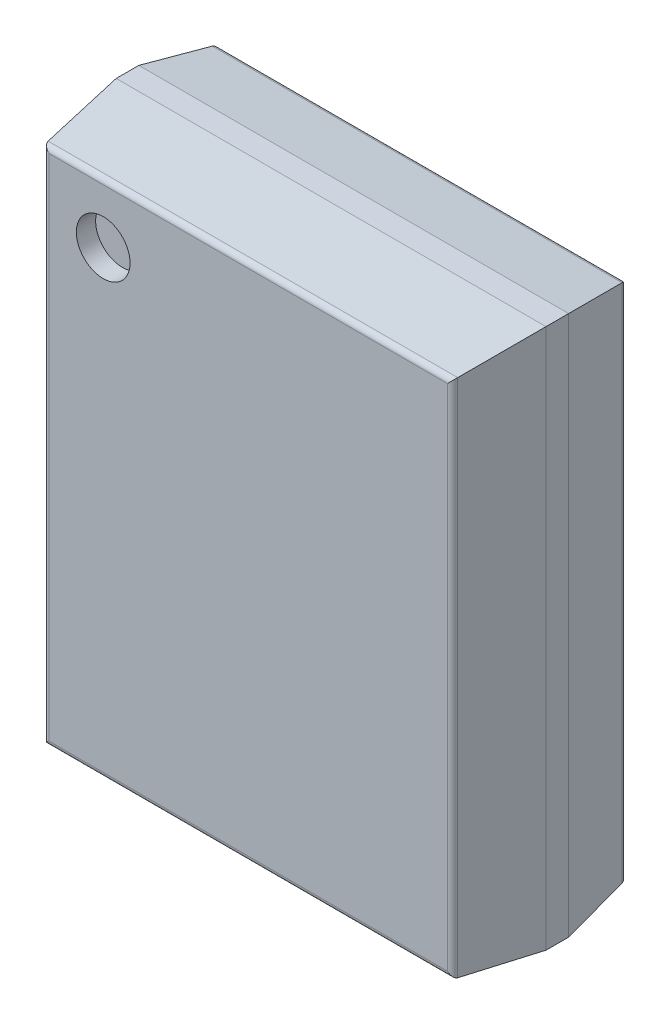
ISO-10303-21;
HEADER;
FILE_DESCRIPTION(('STEP AP214'),'2;1');
FILE_NAME('part.step','',(''),(''),'','','');
FILE_SCHEMA(('AUTOMOTIVE_DESIGN { 1 0 10303 214 1 1 1 1 }'));
ENDSEC;
DATA;
#1=APPLICATION_CONTEXT('core data for automotive mechanical design processes');
#2=APPLICATION_PROTOCOL_DEFINITION('international standard','automotive_design',2000,#1);
#3=PRODUCT_CONTEXT('',#1,'mechanical');
#4=PRODUCT('Part','Part','',(#3));
#5=PRODUCT_RELATED_PRODUCT_CATEGORY('part','',(#4));
#6=PRODUCT_DEFINITION_FORMATION('','',#4);
#7=PRODUCT_DEFINITION_CONTEXT('part definition',#1,'design');
#8=PRODUCT_DEFINITION('design','',#6,#7);
#9=PRODUCT_DEFINITION_SHAPE('','',#8);
#10=(LENGTH_UNIT() NAMED_UNIT(*) SI_UNIT(.MILLI.,.METRE.));
#11=(NAMED_UNIT(*) PLANE_ANGLE_UNIT() SI_UNIT($,.RADIAN.));
#12=(NAMED_UNIT(*) SI_UNIT($,.STERADIAN.) SOLID_ANGLE_UNIT());
#13=UNCERTAINTY_MEASURE_WITH_UNIT(LENGTH_MEASURE(1.E-05),#10,'distance_accuracy_value','');
#14=(GEOMETRIC_REPRESENTATION_CONTEXT(3) GLOBAL_UNCERTAINTY_ASSIGNED_CONTEXT((#13)) GLOBAL_UNIT_ASSIGNED_CONTEXT((#10,
#11,#12)) REPRESENTATION_CONTEXT('',''));
#15=CARTESIAN_POINT('',(0.,0.,0.));
#16=DIRECTION('',(0.,0.,1.));
#17=DIRECTION('',(1.,0.,0.));
#18=AXIS2_PLACEMENT_3D('',#15,#16,#17);
#19=CARTESIAN_POINT('',(-1.315,1.815,1.575));
#20=DIRECTION('',(0.,0.,1.));
#21=DIRECTION('',(1.,0.,0.));
#22=AXIS2_PLACEMENT_3D('',#19,#20,#21);
#23=PLANE('',#22);
#24=CARTESIAN_POINT('',(-1.315,1.815,1.575));
#25=DIRECTION('',(0.,0.,1.));
#26=DIRECTION('',(1.,0.,0.));
#27=AXIS2_PLACEMENT_3D('',#24,#25,#26);
#28=CIRCLE('',#27,0.24375);
#29=CARTESIAN_POINT('',(-1.07125,1.815,1.575));
#30=VERTEX_POINT('',#29);
#31=EDGE_CURVE('E11',#30,#30,#28,.T.);
#32=ORIENTED_EDGE('',*,*,#31,.T.);
#33=EDGE_LOOP('',(#32));
#34=FACE_BOUND('',#33,.T.);
#35=ADVANCED_FACE('F17',(#34),#23,.T.);
#36=CARTESIAN_POINT('',(-1.315,1.815,1.575));
#37=DIRECTION('',(0.,0.,1.));
#38=DIRECTION('',(1.,0.,0.));
#39=AXIS2_PLACEMENT_3D('',#36,#37,#38);
#40=CYLINDRICAL_SURFACE('',#39,0.24375);
#41=DIRECTION('',(0.,0.,1.));
#42=VECTOR('',#41,1.);
#43=CARTESIAN_POINT('',(-1.07125,1.815,1.575));
#44=LINE('',#43,#42);
#45=CARTESIAN_POINT('',(-1.07125,1.815,1.75));
#46=VERTEX_POINT('',#45);
#47=EDGE_CURVE('E25',#30,#46,#44,.T.);
#48=ORIENTED_EDGE('',*,*,#47,.T.);
#49=CARTESIAN_POINT('',(-1.315,1.815,1.75));
#50=DIRECTION('',(0.,0.,1.));
#51=DIRECTION('',(1.,0.,0.));
#52=AXIS2_PLACEMENT_3D('',#49,#50,#51);
#53=CIRCLE('',#52,0.24375);
#54=EDGE_CURVE('E246',#46,#46,#53,.T.);
#55=ORIENTED_EDGE('',*,*,#54,.T.);
#56=ORIENTED_EDGE('',*,*,#47,.F.);
#57=ORIENTED_EDGE('',*,*,#31,.F.);
#58=EDGE_LOOP('',(#48,#55,#56,#57));
#59=FACE_BOUND('',#58,.T.);
#60=ADVANCED_FACE('F708',(#59),#40,.F.);
#61=CARTESIAN_POINT('',(1.808558552786,-2.3525,1.7));
#62=DIRECTION('',(0.,1.,0.));
#63=DIRECTION('',(0.,0.,1.));
#64=AXIS2_PLACEMENT_3D('',#61,#62,#63);
#65=CYLINDRICAL_SURFACE('',#64,0.05);
#66=CARTESIAN_POINT('',(1.808558552786,-2.308558552786,1.7));
#67=DIRECTION('',(-0.707106781186548,-0.707106781186548,0.));
#68=DIRECTION('',(0.707106781186548,-0.707106781186548,0.));
#69=AXIS2_PLACEMENT_3D('',#66,#67,#68);
#70=ELLIPSE('',#69,0.07071067811865,0.05);
#71=CARTESIAN_POINT('',(1.858144342698,-2.358144342698,1.706422572601));
#72=VERTEX_POINT('',#71);
#73=CARTESIAN_POINT('',(1.808558552786,-2.308558552786,1.75));
#74=VERTEX_POINT('',#73);
#75=EDGE_CURVE('E212',#72,#74,#70,.T.);
#76=ORIENTED_EDGE('',*,*,#75,.F.);
#77=DIRECTION('',(0.,1.,0.));
#78=VECTOR('',#77,1.);
#79=CARTESIAN_POINT('',(1.858144342698,-2.3525,1.706422572601));
#80=LINE('',#79,#78);
#81=CARTESIAN_POINT('',(1.858144342698,2.358144342698,1.706422572601));
#82=VERTEX_POINT('',#81);
#83=EDGE_CURVE('E217',#72,#82,#80,.T.);
#84=ORIENTED_EDGE('',*,*,#83,.T.);
#85=CARTESIAN_POINT('',(1.808558552786,2.308558552786,1.7));
#86=DIRECTION('',(-0.707106781186548,0.707106781186548,0.));
#87=DIRECTION('',(0.707106781186548,0.707106781186548,0.));
#88=AXIS2_PLACEMENT_3D('',#85,#86,#87);
#89=ELLIPSE('',#88,0.07071067811865,0.05);
#90=CARTESIAN_POINT('',(1.808558552786,2.308558552786,1.75));
#91=VERTEX_POINT('',#90);
#92=EDGE_CURVE('E249',#91,#82,#89,.T.);
#93=ORIENTED_EDGE('',*,*,#92,.F.);
#94=DIRECTION('',(0.,1.,0.));
#95=VECTOR('',#94,1.);
#96=CARTESIAN_POINT('',(1.808558552786,-2.3525,1.75));
#97=LINE('',#96,#95);
#98=EDGE_CURVE('E272',#74,#91,#97,.T.);
#99=ORIENTED_EDGE('',*,*,#98,.F.);
#100=EDGE_LOOP('',(#76,#84,#93,#99));
#101=FACE_BOUND('',#100,.T.);
#102=ADVANCED_FACE('F697',(#101),#65,.T.);
#103=CARTESIAN_POINT('',(-1.8525,2.308558552786,1.7));
#104=DIRECTION('',(1.,0.,0.));
#105=DIRECTION('',(0.,0.,1.));
#106=AXIS2_PLACEMENT_3D('',#103,#104,#105);
#107=CYLINDRICAL_SURFACE('',#106,0.05);
#108=DIRECTION('',(1.,0.,0.));
#109=VECTOR('',#108,1.);
#110=CARTESIAN_POINT('',(-1.8525,2.308558552786,1.75));
#111=LINE('',#110,#109);
#112=CARTESIAN_POINT('',(-1.808558552786,2.308558552786,1.75));
#113=VERTEX_POINT('',#112);
#114=EDGE_CURVE('E250',#113,#91,#111,.T.);
#115=ORIENTED_EDGE('',*,*,#114,.T.);
#116=ORIENTED_EDGE('',*,*,#92,.T.);
#117=DIRECTION('',(1.,0.,0.));
#118=VECTOR('',#117,1.);
#119=CARTESIAN_POINT('',(-1.8525,2.358144342698,1.706422572601));
#120=LINE('',#119,#118);
#121=CARTESIAN_POINT('',(-1.858144342698,2.358144342698,1.706422572601));
#122=VERTEX_POINT('',#121);
#123=EDGE_CURVE('E319',#122,#82,#120,.T.);
#124=ORIENTED_EDGE('',*,*,#123,.F.);
#125=CARTESIAN_POINT('',(-1.808558552786,2.308558552786,1.7));
#126=DIRECTION('',(0.707106781186548,0.707106781186548,0.));
#127=DIRECTION('',(-0.707106781186548,0.707106781186548,0.));
#128=AXIS2_PLACEMENT_3D('',#125,#126,#127);
#129=ELLIPSE('',#128,0.07071067811865,0.05);
#130=EDGE_CURVE('E315',#122,#113,#129,.T.);
#131=ORIENTED_EDGE('',*,*,#130,.T.);
#132=EDGE_LOOP('',(#115,#116,#124,#131));
#133=FACE_BOUND('',#132,.T.);
#134=ADVANCED_FACE('F686',(#133),#107,.T.);
#135=CARTESIAN_POINT('',(-1.95,-2.45,1.75));
#136=DIRECTION('',(0.,0.,1.));
#137=DIRECTION('',(1.,0.,0.));
#138=AXIS2_PLACEMENT_3D('',#135,#136,#137);
#139=PLANE('',#138);
#140=ORIENTED_EDGE('',*,*,#54,.F.);
#141=EDGE_LOOP('',(#140));
#142=FACE_BOUND('',#141,.T.);
#143=DIRECTION('',(0.,1.,0.));
#144=VECTOR('',#143,1.);
#145=CARTESIAN_POINT('',(-1.808558552786,-2.3525,1.75));
#146=LINE('',#145,#144);
#147=CARTESIAN_POINT('',(-1.808558552786,-2.308558552786,1.75));
#148=VERTEX_POINT('',#147);
#149=EDGE_CURVE('E226',#148,#113,#146,.T.);
#150=ORIENTED_EDGE('',*,*,#149,.F.);
#151=DIRECTION('',(1.,0.,0.));
#152=VECTOR('',#151,1.);
#153=CARTESIAN_POINT('',(-1.8525,-2.308558552786,1.75));
#154=LINE('',#153,#152);
#155=EDGE_CURVE('E216',#148,#74,#154,.T.);
#156=ORIENTED_EDGE('',*,*,#155,.T.);
#157=ORIENTED_EDGE('',*,*,#98,.T.);
#158=ORIENTED_EDGE('',*,*,#114,.F.);
#159=EDGE_LOOP('',(#150,#156,#157,#158));
#160=FACE_BOUND('',#159,.T.);
#161=ADVANCED_FACE('F676',(#142,#160),#139,.T.);
#162=CARTESIAN_POINT('',(-1.8525,-2.308558552786,1.7));
#163=DIRECTION('',(1.,0.,0.));
#164=DIRECTION('',(0.,-0.991715798237691,0.12845145201896));
#165=AXIS2_PLACEMENT_3D('',#162,#163,#164);
#166=CYLINDRICAL_SURFACE('',#165,0.05);
#167=DIRECTION('',(1.,0.,0.));
#168=VECTOR('',#167,1.);
#169=CARTESIAN_POINT('',(-1.8525,-2.358144342698,1.706422572601));
#170=LINE('',#169,#168);
#171=CARTESIAN_POINT('',(-1.858144342698,-2.358144342698,1.706422572601));
#172=VERTEX_POINT('',#171);
#173=EDGE_CURVE('E227',#172,#72,#170,.T.);
#174=ORIENTED_EDGE('',*,*,#173,.T.);
#175=ORIENTED_EDGE('',*,*,#75,.T.);
#176=ORIENTED_EDGE('',*,*,#155,.F.);
#177=CARTESIAN_POINT('',(-1.808558552786,-2.308558552786,1.7));
#178=DIRECTION('',(-0.707106781186548,0.707106781186548,0.));
#179=DIRECTION('',(0.707106781186548,0.707106781186548,0.));
#180=AXIS2_PLACEMENT_3D('',#177,#178,#179);
#181=ELLIPSE('',#180,0.07071067811865,0.05);
#182=EDGE_CURVE('E222',#172,#148,#181,.T.);
#183=ORIENTED_EDGE('',*,*,#182,.F.);
#184=EDGE_LOOP('',(#174,#175,#176,#183));
#185=FACE_BOUND('',#184,.T.);
#186=ADVANCED_FACE('F665',(#185),#166,.T.);
#187=CARTESIAN_POINT('',(1.90125,-2.45,1.373623210137));
#188=DIRECTION('',(0.991715798237691,0.,0.12845145201896));
#189=DIRECTION('',(0.,-1.,0.));
#190=AXIS2_PLACEMENT_3D('',#187,#188,#189);
#191=PLANE('',#190);
#192=DIRECTION('',(-0.12740467794397,0.12740467794397,0.983634127140771));
#193=VECTOR('',#192,1.);
#194=CARTESIAN_POINT('',(1.870389001332,-2.370389001332,1.611887079072));
#195=LINE('',#194,#193);
#196=CARTESIAN_POINT('',(1.95,-2.45,0.997246420274));
#197=VERTEX_POINT('',#196);
#198=EDGE_CURVE('E257',#197,#72,#195,.T.);
#199=ORIENTED_EDGE('',*,*,#198,.F.);
#200=DIRECTION('',(0.,1.,0.));
#201=VECTOR('',#200,1.);
#202=CARTESIAN_POINT('',(1.95,-2.45,0.997246420274));
#203=LINE('',#202,#201);
#204=CARTESIAN_POINT('',(1.95,2.45,0.997246420274));
#205=VERTEX_POINT('',#204);
#206=EDGE_CURVE('E305',#197,#205,#203,.T.);
#207=ORIENTED_EDGE('',*,*,#206,.T.);
#208=DIRECTION('',(-0.12740467794397,-0.12740467794397,0.983634127140771));
#209=VECTOR('',#208,1.);
#210=CARTESIAN_POINT('',(1.830620719025,2.330620719025,1.91892007257));
#211=LINE('',#210,#209);
#212=EDGE_CURVE('E323',#205,#82,#211,.T.);
#213=ORIENTED_EDGE('',*,*,#212,.T.);
#214=ORIENTED_EDGE('',*,*,#83,.F.);
#215=EDGE_LOOP('',(#199,#207,#213,#214));
#216=FACE_BOUND('',#215,.T.);
#217=ADVANCED_FACE('F654',(#216),#191,.T.);
#218=CARTESIAN_POINT('',(-1.95,2.40125,1.373623210137));
#219=DIRECTION('',(0.,0.991715798237691,0.12845145201896));
#220=DIRECTION('',(1.,0.,0.));
#221=AXIS2_PLACEMENT_3D('',#218,#219,#220);
#222=PLANE('',#221);
#223=ORIENTED_EDGE('',*,*,#123,.T.);
#224=ORIENTED_EDGE('',*,*,#212,.F.);
#225=DIRECTION('',(1.,0.,0.));
#226=VECTOR('',#225,1.);
#227=CARTESIAN_POINT('',(-1.95,2.45,0.997246420274));
#228=LINE('',#227,#226);
#229=CARTESIAN_POINT('',(-1.95,2.45,0.997246420274));
#230=VERTEX_POINT('',#229);
#231=EDGE_CURVE('E301',#230,#205,#228,.T.);
#232=ORIENTED_EDGE('',*,*,#231,.F.);
#233=DIRECTION('',(0.12740467794397,-0.12740467794397,0.983634127140771));
#234=VECTOR('',#233,1.);
#235=CARTESIAN_POINT('',(-1.862273025351,2.362273025351,1.674546873663));
#236=LINE('',#235,#234);
#237=EDGE_CURVE('E286',#230,#122,#236,.T.);
#238=ORIENTED_EDGE('',*,*,#237,.T.);
#239=EDGE_LOOP('',(#223,#224,#232,#238));
#240=FACE_BOUND('',#239,.T.);
#241=ADVANCED_FACE('F644',(#240),#222,.T.);
#242=CARTESIAN_POINT('',(-1.808558552786,-2.3525,1.7));
#243=DIRECTION('',(0.,1.,0.));
#244=DIRECTION('',(-0.991715798237691,0.,0.12845145201896));
#245=AXIS2_PLACEMENT_3D('',#242,#243,#244);
#246=CYLINDRICAL_SURFACE('',#245,0.05);
#247=ORIENTED_EDGE('',*,*,#182,.T.);
#248=ORIENTED_EDGE('',*,*,#149,.T.);
#249=ORIENTED_EDGE('',*,*,#130,.F.);
#250=DIRECTION('',(0.,1.,0.));
#251=VECTOR('',#250,1.);
#252=CARTESIAN_POINT('',(-1.858144342698,-2.3525,1.706422572601));
#253=LINE('',#252,#251);
#254=EDGE_CURVE('E282',#172,#122,#253,.T.);
#255=ORIENTED_EDGE('',*,*,#254,.F.);
#256=EDGE_LOOP('',(#247,#248,#249,#255));
#257=FACE_BOUND('',#256,.T.);
#258=ADVANCED_FACE('F633',(#257),#246,.T.);
#259=CARTESIAN_POINT('',(-1.95,-2.40125,1.373623210137));
#260=DIRECTION('',(0.,0.991715798237691,-0.12845145201896));
#261=DIRECTION('',(-1.,0.,0.));
#262=AXIS2_PLACEMENT_3D('',#259,#260,#261);
#263=PLANE('',#262);
#264=DIRECTION('',(0.12740467794397,0.12740467794397,0.983634127140771));
#265=VECTOR('',#264,1.);
#266=CARTESIAN_POINT('',(-1.902041307658,-2.402041307658,1.367513880164));
#267=LINE('',#266,#265);
#268=CARTESIAN_POINT('',(-1.95,-2.45,0.997246420274));
#269=VERTEX_POINT('',#268);
#270=EDGE_CURVE('E290',#269,#172,#267,.T.);
#271=ORIENTED_EDGE('',*,*,#270,.F.);
#272=DIRECTION('',(1.,0.,0.));
#273=VECTOR('',#272,1.);
#274=CARTESIAN_POINT('',(-1.95,-2.45,0.997246420274));
#275=LINE('',#274,#273);
#276=EDGE_CURVE('E253',#269,#197,#275,.T.);
#277=ORIENTED_EDGE('',*,*,#276,.T.);
#278=ORIENTED_EDGE('',*,*,#198,.T.);
#279=ORIENTED_EDGE('',*,*,#173,.F.);
#280=EDGE_LOOP('',(#271,#277,#278,#279));
#281=FACE_BOUND('',#280,.T.);
#282=ADVANCED_FACE('F623',(#281),#263,.F.);
#283=CARTESIAN_POINT('',(1.95,-2.45,0.175));
#284=DIRECTION('',(1.,0.,0.));
#285=DIRECTION('',(0.,1.,0.));
#286=AXIS2_PLACEMENT_3D('',#283,#284,#285);
#287=PLANE('',#286);
#288=DIRECTION('',(0.,0.,1.));
#289=VECTOR('',#288,1.);
#290=CARTESIAN_POINT('',(1.95,-2.45,0.175));
#291=LINE('',#290,#289);
#292=CARTESIAN_POINT('',(1.95,-2.45,0.792246420274));
#293=VERTEX_POINT('',#292);
#294=EDGE_CURVE('E195',#293,#197,#291,.T.);
#295=ORIENTED_EDGE('',*,*,#294,.F.);
#296=DIRECTION('',(0.,1.,0.));
#297=VECTOR('',#296,1.);
#298=CARTESIAN_POINT('',(1.95,-2.45,0.792246420274));
#299=LINE('',#298,#297);
#300=CARTESIAN_POINT('',(1.95,2.45,0.792246420274));
#301=VERTEX_POINT('',#300);
#302=EDGE_CURVE('E194',#293,#301,#299,.T.);
#303=ORIENTED_EDGE('',*,*,#302,.T.);
#304=DIRECTION('',(0.,0.,1.));
#305=VECTOR('',#304,1.);
#306=CARTESIAN_POINT('',(1.95,2.45,0.175));
#307=LINE('',#306,#305);
#308=EDGE_CURVE('E294',#301,#205,#307,.T.);
#309=ORIENTED_EDGE('',*,*,#308,.T.);
#310=ORIENTED_EDGE('',*,*,#206,.F.);
#311=EDGE_LOOP('',(#295,#303,#309,#310));
#312=FACE_BOUND('',#311,.T.);
#313=ADVANCED_FACE('F612',(#312),#287,.T.);
#314=CARTESIAN_POINT('',(1.809778042507,-2.3525,0.225));
#315=DIRECTION('',(0.,1.,0.));
#316=DIRECTION('',(0.,0.,-1.));
#317=AXIS2_PLACEMENT_3D('',#314,#315,#316);
#318=CYLINDRICAL_SURFACE('',#317,0.05);
#319=DIRECTION('',(0.,1.,0.));
#320=VECTOR('',#319,1.);
#321=CARTESIAN_POINT('',(1.809778042507,-2.3525,0.175));
#322=LINE('',#321,#320);
#323=CARTESIAN_POINT('',(1.809778042507,-2.309778042507,0.175));
#324=VERTEX_POINT('',#323);
#325=CARTESIAN_POINT('',(1.809778042507,2.309778042507,0.175));
#326=VERTEX_POINT('',#325);
#327=EDGE_CURVE('E271',#324,#326,#322,.T.);
#328=ORIENTED_EDGE('',*,*,#327,.T.);
#329=CARTESIAN_POINT('',(1.809778042507,2.309778042507,0.225));
#330=DIRECTION('',(0.707106781186548,-0.707106781186548,0.));
#331=DIRECTION('',(0.707106781186548,0.707106781186548,0.));
#332=AXIS2_PLACEMENT_3D('',#329,#330,#331);
#333=ELLIPSE('',#332,0.07071067811865,0.05);
#334=CARTESIAN_POINT('',(1.859165697143,2.359165697143,0.217198745641));
#335=VERTEX_POINT('',#334);
#336=EDGE_CURVE('E279',#326,#335,#333,.T.);
#337=ORIENTED_EDGE('',*,*,#336,.T.);
#338=DIRECTION('',(0.,1.,0.));
#339=VECTOR('',#338,1.);
#340=CARTESIAN_POINT('',(1.859165697143,-2.3525,0.217198745641));
#341=LINE('',#340,#339);
#342=CARTESIAN_POINT('',(1.859165697143,-2.359165697143,0.217198745641));
#343=VERTEX_POINT('',#342);
#344=EDGE_CURVE('E191',#343,#335,#341,.T.);
#345=ORIENTED_EDGE('',*,*,#344,.F.);
#346=CARTESIAN_POINT('',(1.809778042507,-2.309778042507,0.225));
#347=DIRECTION('',(0.707106781186548,0.707106781186548,0.));
#348=DIRECTION('',(0.707106781186548,-0.707106781186548,0.));
#349=AXIS2_PLACEMENT_3D('',#346,#347,#348);
#350=ELLIPSE('',#349,0.07071067811865,0.05);
#351=EDGE_CURVE('E160',#343,#324,#350,.T.);
#352=ORIENTED_EDGE('',*,*,#351,.T.);
#353=EDGE_LOOP('',(#328,#337,#345,#352));
#354=FACE_BOUND('',#353,.T.);
#355=ADVANCED_FACE('F602',(#354),#318,.T.);
#356=CARTESIAN_POINT('',(-1.95,2.45,0.175));
#357=DIRECTION('',(0.,1.,0.));
#358=DIRECTION('',(1.,0.,0.));
#359=AXIS2_PLACEMENT_3D('',#356,#357,#358);
#360=PLANE('',#359);
#361=ORIENTED_EDGE('',*,*,#308,.F.);
#362=DIRECTION('',(1.,0.,0.));
#363=VECTOR('',#362,1.);
#364=CARTESIAN_POINT('',(-1.95,2.45,0.792246420274));
#365=LINE('',#364,#363);
#366=CARTESIAN_POINT('',(-1.95,2.45,0.792246420274));
#367=VERTEX_POINT('',#366);
#368=EDGE_CURVE('E231',#367,#301,#365,.T.);
#369=ORIENTED_EDGE('',*,*,#368,.F.);
#370=DIRECTION('',(0.,0.,1.));
#371=VECTOR('',#370,1.);
#372=CARTESIAN_POINT('',(-1.95,2.45,0.175));
#373=LINE('',#372,#371);
#374=EDGE_CURVE('E211',#367,#230,#373,.T.);
#375=ORIENTED_EDGE('',*,*,#374,.T.);
#376=ORIENTED_EDGE('',*,*,#231,.T.);
#377=EDGE_LOOP('',(#361,#369,#375,#376));
#378=FACE_BOUND('',#377,.T.);
#379=ADVANCED_FACE('F592',(#378),#360,.T.);
#380=CARTESIAN_POINT('',(-1.90125,-2.45,1.373623210137));
#381=DIRECTION('',(0.991715798237691,0.,-0.12845145201896));
#382=DIRECTION('',(0.,-1.,0.));
#383=AXIS2_PLACEMENT_3D('',#380,#381,#382);
#384=PLANE('',#383);
#385=ORIENTED_EDGE('',*,*,#254,.T.);
#386=ORIENTED_EDGE('',*,*,#237,.F.);
#387=DIRECTION('',(0.,1.,0.));
#388=VECTOR('',#387,1.);
#389=CARTESIAN_POINT('',(-1.95,-2.45,0.997246420274));
#390=LINE('',#389,#388);
#391=EDGE_CURVE('E153',#269,#230,#390,.T.);
#392=ORIENTED_EDGE('',*,*,#391,.F.);
#393=ORIENTED_EDGE('',*,*,#270,.T.);
#394=EDGE_LOOP('',(#385,#386,#392,#393));
#395=FACE_BOUND('',#394,.T.);
#396=ADVANCED_FACE('F581',(#395),#384,.F.);
#397=CARTESIAN_POINT('',(-1.8525,2.309778042507,0.225));
#398=DIRECTION('',(1.,0.,0.));
#399=DIRECTION('',(0.,0.,-1.));
#400=AXIS2_PLACEMENT_3D('',#397,#398,#399);
#401=CYLINDRICAL_SURFACE('',#400,0.05);
#402=CARTESIAN_POINT('',(-1.809778042507,2.309778042507,0.225));
#403=DIRECTION('',(-0.707106781186548,-0.707106781186548,0.));
#404=DIRECTION('',(-0.707106781186548,0.707106781186548,0.));
#405=AXIS2_PLACEMENT_3D('',#402,#403,#404);
#406=ELLIPSE('',#405,0.07071067811865,0.05);
#407=CARTESIAN_POINT('',(-1.859165697143,2.359165697143,0.217198745641));
#408=VERTEX_POINT('',#407);
#409=CARTESIAN_POINT('',(-1.809778042507,2.309778042507,0.175));
#410=VERTEX_POINT('',#409);
#411=EDGE_CURVE('E199',#408,#410,#406,.T.);
#412=ORIENTED_EDGE('',*,*,#411,.F.);
#413=DIRECTION('',(1.,0.,0.));
#414=VECTOR('',#413,1.);
#415=CARTESIAN_POINT('',(-1.8525,2.359165697143,0.217198745641));
#416=LINE('',#415,#414);
#417=EDGE_CURVE('E232',#408,#335,#416,.T.);
#418=ORIENTED_EDGE('',*,*,#417,.T.);
#419=ORIENTED_EDGE('',*,*,#336,.F.);
#420=DIRECTION('',(1.,0.,0.));
#421=VECTOR('',#420,1.);
#422=CARTESIAN_POINT('',(-1.8525,2.309778042507,0.175));
#423=LINE('',#422,#421);
#424=EDGE_CURVE('E267',#410,#326,#423,.T.);
#425=ORIENTED_EDGE('',*,*,#424,.F.);
#426=EDGE_LOOP('',(#412,#418,#419,#425));
#427=FACE_BOUND('',#426,.T.);
#428=ADVANCED_FACE('F569',(#427),#401,.T.);
#429=CARTESIAN_POINT('',(-1.95,-2.45,0.175));
#430=DIRECTION('',(0.,0.,1.));
#431=DIRECTION('',(1.,0.,0.));
#432=AXIS2_PLACEMENT_3D('',#429,#430,#431);
#433=PLANE('',#432);
#434=ORIENTED_EDGE('',*,*,#424,.T.);
#435=ORIENTED_EDGE('',*,*,#327,.F.);
#436=DIRECTION('',(1.,0.,0.));
#437=VECTOR('',#436,1.);
#438=CARTESIAN_POINT('',(-1.8525,-2.309778042507,0.175));
#439=LINE('',#438,#437);
#440=CARTESIAN_POINT('',(-1.809778042507,-2.309778042507,0.175));
#441=VERTEX_POINT('',#440);
#442=EDGE_CURVE('E236',#441,#324,#439,.T.);
#443=ORIENTED_EDGE('',*,*,#442,.F.);
#444=DIRECTION('',(0.,1.,0.));
#445=VECTOR('',#444,1.);
#446=CARTESIAN_POINT('',(-1.809778042507,-2.3525,0.175));
#447=LINE('',#446,#445);
#448=EDGE_CURVE('E149',#441,#410,#447,.T.);
#449=ORIENTED_EDGE('',*,*,#448,.T.);
#450=EDGE_LOOP('',(#434,#435,#443,#449));
#451=FACE_BOUND('',#450,.T.);
#452=ADVANCED_FACE('F557',(#451),#433,.F.);
#453=CARTESIAN_POINT('',(1.90125,-2.45,0.483623210137));
#454=DIRECTION('',(-0.987753092714965,0.,0.156025087187994));
#455=DIRECTION('',(0.,1.,0.));
#456=AXIS2_PLACEMENT_3D('',#453,#454,#455);
#457=PLANE('',#456);
#458=ORIENTED_EDGE('',*,*,#344,.T.);
#459=DIRECTION('',(-0.154159948465985,-0.154159948465985,-0.975945398358909));
#460=VECTOR('',#459,1.);
#461=CARTESIAN_POINT('',(1.797841283145,2.297841283145,-0.171029716054));
#462=LINE('',#461,#460);
#463=EDGE_CURVE('E237',#301,#335,#462,.T.);
#464=ORIENTED_EDGE('',*,*,#463,.F.);
#465=ORIENTED_EDGE('',*,*,#302,.F.);
#466=DIRECTION('',(-0.154159948465985,0.154159948465985,-0.975945398358909));
#467=VECTOR('',#466,1.);
#468=CARTESIAN_POINT('',(1.856066242937,-2.356066242937,0.197576930121));
#469=LINE('',#468,#467);
#470=EDGE_CURVE('E166',#293,#343,#469,.T.);
#471=ORIENTED_EDGE('',*,*,#470,.T.);
#472=EDGE_LOOP('',(#458,#464,#465,#471));
#473=FACE_BOUND('',#472,.T.);
#474=ADVANCED_FACE('F547',(#473),#457,.F.);
#475=CARTESIAN_POINT('',(-1.95,-2.45,0.175));
#476=DIRECTION('',(0.,1.,0.));
#477=DIRECTION('',(1.,0.,0.));
#478=AXIS2_PLACEMENT_3D('',#475,#476,#477);
#479=PLANE('',#478);
#480=ORIENTED_EDGE('',*,*,#276,.F.);
#481=DIRECTION('',(0.,0.,1.));
#482=VECTOR('',#481,1.);
#483=CARTESIAN_POINT('',(-1.95,-2.45,0.175));
#484=LINE('',#483,#482);
#485=CARTESIAN_POINT('',(-1.95,-2.45,0.792246420274));
#486=VERTEX_POINT('',#485);
#487=EDGE_CURVE('E221',#486,#269,#484,.T.);
#488=ORIENTED_EDGE('',*,*,#487,.F.);
#489=DIRECTION('',(1.,0.,0.));
#490=VECTOR('',#489,1.);
#491=CARTESIAN_POINT('',(-1.95,-2.45,0.792246420274));
#492=LINE('',#491,#490);
#493=EDGE_CURVE('E180',#486,#293,#492,.T.);
#494=ORIENTED_EDGE('',*,*,#493,.T.);
#495=ORIENTED_EDGE('',*,*,#294,.T.);
#496=EDGE_LOOP('',(#480,#488,#494,#495));
#497=FACE_BOUND('',#496,.T.);
#498=ADVANCED_FACE('F537',(#497),#479,.F.);
#499=CARTESIAN_POINT('',(-1.8525,-2.309778042507,0.225));
#500=DIRECTION('',(1.,0.,0.));
#501=DIRECTION('',(0.,-0.987753092714965,-0.156025087187994));
#502=AXIS2_PLACEMENT_3D('',#499,#500,#501);
#503=CYLINDRICAL_SURFACE('',#502,0.05);
#504=CARTESIAN_POINT('',(-1.809778042507,-2.309778042507,0.225));
#505=DIRECTION('',(0.707106781186548,-0.707106781186548,0.));
#506=DIRECTION('',(0.707106781186548,0.707106781186548,0.));
#507=AXIS2_PLACEMENT_3D('',#504,#505,#506);
#508=ELLIPSE('',#507,0.07071067811865,0.05);
#509=CARTESIAN_POINT('',(-1.859165697143,-2.359165697143,0.217198745641));
#510=VERTEX_POINT('',#509);
#511=EDGE_CURVE('E141',#510,#441,#508,.T.);
#512=ORIENTED_EDGE('',*,*,#511,.T.);
#513=ORIENTED_EDGE('',*,*,#442,.T.);
#514=ORIENTED_EDGE('',*,*,#351,.F.);
#515=DIRECTION('',(1.,0.,0.));
#516=VECTOR('',#515,1.);
#517=CARTESIAN_POINT('',(-1.8525,-2.359165697143,0.217198745641));
#518=LINE('',#517,#516);
#519=EDGE_CURVE('E157',#510,#343,#518,.T.);
#520=ORIENTED_EDGE('',*,*,#519,.F.);
#521=EDGE_LOOP('',(#512,#513,#514,#520));
#522=FACE_BOUND('',#521,.T.);
#523=ADVANCED_FACE('F158',(#522),#503,.T.);
#524=CARTESIAN_POINT('',(-1.95,2.40125,0.483623210137));
#525=DIRECTION('',(0.,-0.987753092714965,0.156025087187994));
#526=DIRECTION('',(-1.,0.,0.));
#527=AXIS2_PLACEMENT_3D('',#524,#525,#526);
#528=PLANE('',#527);
#529=DIRECTION('',(0.154159948465985,-0.154159948465985,-0.975945398358909));
#530=VECTOR('',#529,1.);
#531=CARTESIAN_POINT('',(-1.844183598082,2.344183598082,0.122351083963));
#532=LINE('',#531,#530);
#533=EDGE_CURVE('E174',#367,#408,#532,.T.);
#534=ORIENTED_EDGE('',*,*,#533,.F.);
#535=ORIENTED_EDGE('',*,*,#368,.T.);
#536=ORIENTED_EDGE('',*,*,#463,.T.);
#537=ORIENTED_EDGE('',*,*,#417,.F.);
#538=EDGE_LOOP('',(#534,#535,#536,#537));
#539=FACE_BOUND('',#538,.T.);
#540=ADVANCED_FACE('F515',(#539),#528,.F.);
#541=CARTESIAN_POINT('',(-1.95,-2.45,0.175));
#542=DIRECTION('',(1.,0.,0.));
#543=DIRECTION('',(0.,1.,0.));
#544=AXIS2_PLACEMENT_3D('',#541,#542,#543);
#545=PLANE('',#544);
#546=ORIENTED_EDGE('',*,*,#391,.T.);
#547=ORIENTED_EDGE('',*,*,#374,.F.);
#548=DIRECTION('',(0.,1.,0.));
#549=VECTOR('',#548,1.);
#550=CARTESIAN_POINT('',(-1.95,-2.45,0.792246420274));
#551=LINE('',#550,#549);
#552=EDGE_CURVE('E183',#486,#367,#551,.T.);
#553=ORIENTED_EDGE('',*,*,#552,.F.);
#554=ORIENTED_EDGE('',*,*,#487,.T.);
#555=EDGE_LOOP('',(#546,#547,#553,#554));
#556=FACE_BOUND('',#555,.T.);
#557=ADVANCED_FACE('F503',(#556),#545,.F.);
#558=CARTESIAN_POINT('',(-1.809778042507,-2.3525,0.225));
#559=DIRECTION('',(0.,1.,0.));
#560=DIRECTION('',(-0.987753092714965,0.,-0.156025087187994));
#561=AXIS2_PLACEMENT_3D('',#558,#559,#560);
#562=CYLINDRICAL_SURFACE('',#561,0.05);
#563=DIRECTION('',(0.,1.,0.));
#564=VECTOR('',#563,1.);
#565=CARTESIAN_POINT('',(-1.859165697143,-2.3525,0.217198745641));
#566=LINE('',#565,#564);
#567=EDGE_CURVE('E146',#510,#408,#566,.T.);
#568=ORIENTED_EDGE('',*,*,#567,.T.);
#569=ORIENTED_EDGE('',*,*,#411,.T.);
#570=ORIENTED_EDGE('',*,*,#448,.F.);
#571=ORIENTED_EDGE('',*,*,#511,.F.);
#572=EDGE_LOOP('',(#568,#569,#570,#571));
#573=FACE_BOUND('',#572,.T.);
#574=ADVANCED_FACE('F143',(#573),#562,.T.);
#575=CARTESIAN_POINT('',(-1.95,-2.40125,0.483623210137));
#576=DIRECTION('',(0.,-0.987753092714965,-0.156025087187994));
#577=DIRECTION('',(0.,0.156025087187994,-0.987753092714965));
#578=AXIS2_PLACEMENT_3D('',#575,#576,#577);
#579=PLANE('',#578);
#580=ORIENTED_EDGE('',*,*,#519,.T.);
#581=ORIENTED_EDGE('',*,*,#470,.F.);
#582=ORIENTED_EDGE('',*,*,#493,.F.);
#583=DIRECTION('',(0.154159948465985,0.154159948465985,-0.975945398358909));
#584=VECTOR('',#583,1.);
#585=CARTESIAN_POINT('',(-1.902408557873,-2.402408557873,0.490957730138));
#586=LINE('',#585,#584);
#587=EDGE_CURVE('E172',#486,#510,#586,.T.);
#588=ORIENTED_EDGE('',*,*,#587,.T.);
#589=EDGE_LOOP('',(#580,#581,#582,#588));
#590=FACE_BOUND('',#589,.T.);
#591=ADVANCED_FACE('F178',(#590),#579,.T.);
#592=CARTESIAN_POINT('',(-1.90125,-2.45,0.483623210137));
#593=DIRECTION('',(-0.987753092714965,0.,-0.156025087187994));
#594=DIRECTION('',(-0.156025087187994,0.,0.987753092714965));
#595=AXIS2_PLACEMENT_3D('',#592,#593,#594);
#596=PLANE('',#595);
#597=ORIENTED_EDGE('',*,*,#587,.F.);
#598=ORIENTED_EDGE('',*,*,#552,.T.);
#599=ORIENTED_EDGE('',*,*,#533,.T.);
#600=ORIENTED_EDGE('',*,*,#567,.F.);
#601=EDGE_LOOP('',(#597,#598,#599,#600));
#602=FACE_BOUND('',#601,.T.);
#603=ADVANCED_FACE('F170',(#602),#596,.T.);
#604=CLOSED_SHELL('',(#35,#60,#102,#134,#161,#186,#217,#241,#258,#282,#313,#355,#379,#396,#428,
#452,#474,#498,#523,#540,#557,#574,#591,#603));
#605=MANIFOLD_SOLID_BREP('B1',#604);
#606=ADVANCED_BREP_SHAPE_REPRESENTATION('',(#18,#605),#14);
#607=SHAPE_DEFINITION_REPRESENTATION(#9,#606);
ENDSEC;
END-ISO-10303-21;
